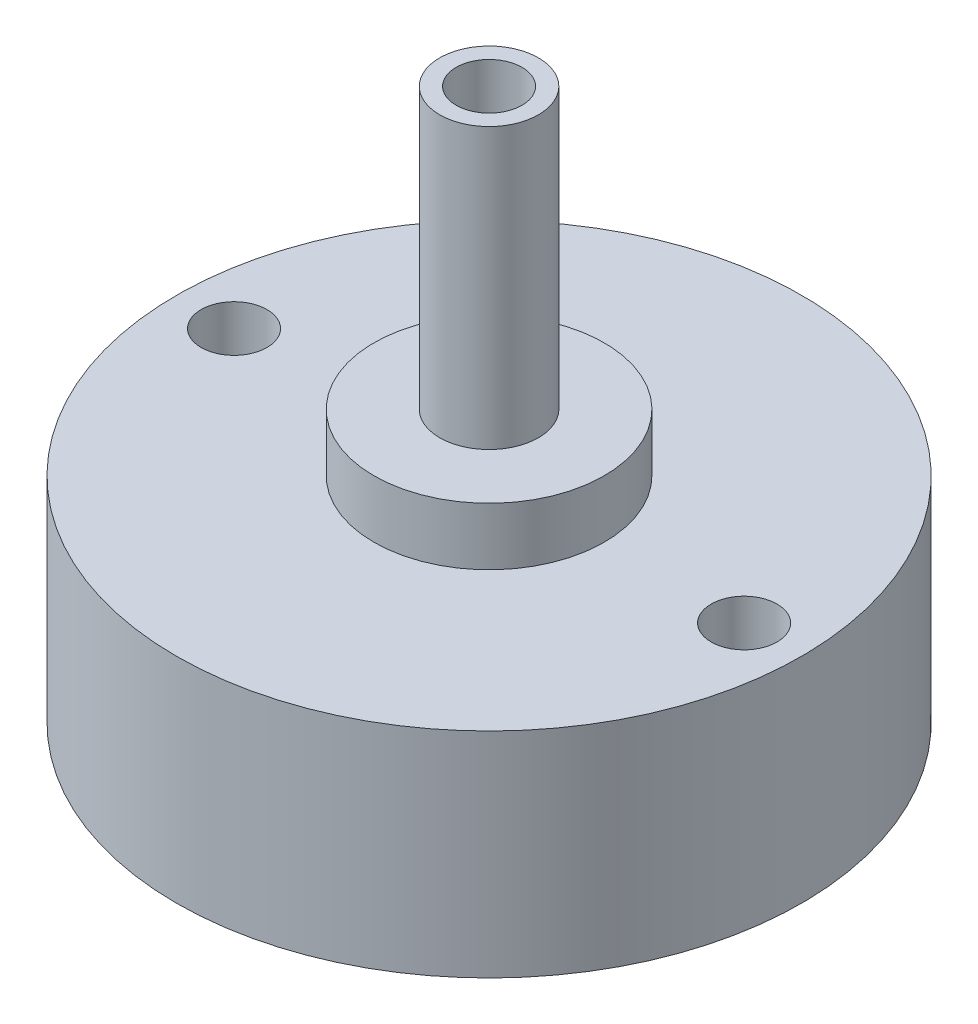
ISO-10303-21;
HEADER;
FILE_DESCRIPTION(('STEP AP214'),'2;1');
FILE_NAME('part.step','',(''),(''),'','','');
FILE_SCHEMA(('AUTOMOTIVE_DESIGN { 1 0 10303 214 1 1 1 1 }'));
ENDSEC;
DATA;
#1=APPLICATION_CONTEXT('core data for automotive mechanical design processes');
#2=APPLICATION_PROTOCOL_DEFINITION('international standard','automotive_design',2000,#1);
#3=PRODUCT_CONTEXT('',#1,'mechanical');
#4=PRODUCT('Part','Part','',(#3));
#5=PRODUCT_RELATED_PRODUCT_CATEGORY('part','',(#4));
#6=PRODUCT_DEFINITION_FORMATION('','',#4);
#7=PRODUCT_DEFINITION_CONTEXT('part definition',#1,'design');
#8=PRODUCT_DEFINITION('design','',#6,#7);
#9=PRODUCT_DEFINITION_SHAPE('','',#8);
#10=(LENGTH_UNIT() NAMED_UNIT(*) SI_UNIT(.MILLI.,.METRE.));
#11=(NAMED_UNIT(*) PLANE_ANGLE_UNIT() SI_UNIT($,.RADIAN.));
#12=(NAMED_UNIT(*) SI_UNIT($,.STERADIAN.) SOLID_ANGLE_UNIT());
#13=UNCERTAINTY_MEASURE_WITH_UNIT(LENGTH_MEASURE(1.E-05),#10,'distance_accuracy_value','');
#14=(GEOMETRIC_REPRESENTATION_CONTEXT(3) GLOBAL_UNCERTAINTY_ASSIGNED_CONTEXT((#13)) GLOBAL_UNIT_ASSIGNED_CONTEXT((#10,
#11,#12)) REPRESENTATION_CONTEXT('',''));
#15=CARTESIAN_POINT('',(0.,0.,0.));
#16=DIRECTION('',(0.,0.,1.));
#17=DIRECTION('',(1.,0.,0.));
#18=AXIS2_PLACEMENT_3D('',#15,#16,#17);
#19=CARTESIAN_POINT('',(0.,3.5,0.));
#20=DIRECTION('',(0.,1.,0.));
#21=DIRECTION('',(0.,0.,1.));
#22=AXIS2_PLACEMENT_3D('',#19,#20,#21);
#23=PLANE('',#22);
#24=CARTESIAN_POINT('',(0.,3.5,0.));
#25=DIRECTION('',(0.,1.,0.));
#26=DIRECTION('',(0.,0.,1.));
#27=AXIS2_PLACEMENT_3D('',#24,#25,#26);
#28=CIRCLE('',#27,7.);
#29=CARTESIAN_POINT('',(0.,3.5,7.));
#30=VERTEX_POINT('',#29);
#31=EDGE_CURVE('E57',#30,#30,#28,.T.);
#32=ORIENTED_EDGE('',*,*,#31,.T.);
#33=EDGE_LOOP('',(#32));
#34=FACE_BOUND('',#33,.T.);
#35=CARTESIAN_POINT('',(0.,3.5,0.));
#36=DIRECTION('',(0.,1.,0.));
#37=DIRECTION('',(0.,0.,1.));
#38=AXIS2_PLACEMENT_3D('',#35,#36,#37);
#39=CIRCLE('',#38,3.);
#40=CARTESIAN_POINT('',(0.,3.5,3.));
#41=VERTEX_POINT('',#40);
#42=EDGE_CURVE('E66',#41,#41,#39,.T.);
#43=ORIENTED_EDGE('',*,*,#42,.F.);
#44=EDGE_LOOP('',(#43));
#45=FACE_BOUND('',#44,.T.);
#46=ADVANCED_FACE('F30',(#34,#45),#23,.T.);
#47=CARTESIAN_POINT('',(0.,0.,0.));
#48=DIRECTION('',(0.,1.,0.));
#49=DIRECTION('',(0.,0.,1.));
#50=AXIS2_PLACEMENT_3D('',#47,#48,#49);
#51=PLANE('',#50);
#52=CARTESIAN_POINT('',(0.,0.,0.));
#53=DIRECTION('',(0.,1.,0.));
#54=DIRECTION('',(0.,0.,1.));
#55=AXIS2_PLACEMENT_3D('',#52,#53,#54);
#56=CIRCLE('',#55,19.);
#57=CARTESIAN_POINT('',(0.,0.,19.));
#58=VERTEX_POINT('',#57);
#59=EDGE_CURVE('E41',#58,#58,#56,.T.);
#60=ORIENTED_EDGE('',*,*,#59,.T.);
#61=EDGE_LOOP('',(#60));
#62=FACE_BOUND('',#61,.T.);
#63=CARTESIAN_POINT('',(-15.5,0.,0.));
#64=DIRECTION('',(0.,1.,0.));
#65=DIRECTION('',(0.,0.,1.));
#66=AXIS2_PLACEMENT_3D('',#63,#64,#65);
#67=CIRCLE('',#66,2.);
#68=CARTESIAN_POINT('',(-15.5,0.,2.));
#69=VERTEX_POINT('',#68);
#70=EDGE_CURVE('E48',#69,#69,#67,.T.);
#71=ORIENTED_EDGE('',*,*,#70,.F.);
#72=EDGE_LOOP('',(#71));
#73=FACE_BOUND('',#72,.T.);
#74=CARTESIAN_POINT('',(15.5,0.,0.));
#75=DIRECTION('',(0.,1.,0.));
#76=DIRECTION('',(0.,0.,1.));
#77=AXIS2_PLACEMENT_3D('',#74,#75,#76);
#78=CIRCLE('',#77,2.);
#79=CARTESIAN_POINT('',(15.5,0.,2.));
#80=VERTEX_POINT('',#79);
#81=EDGE_CURVE('E54',#80,#80,#78,.T.);
#82=ORIENTED_EDGE('',*,*,#81,.F.);
#83=EDGE_LOOP('',(#82));
#84=FACE_BOUND('',#83,.T.);
#85=CARTESIAN_POINT('',(0.,0.,0.));
#86=DIRECTION('',(0.,1.,0.));
#87=DIRECTION('',(0.,0.,1.));
#88=AXIS2_PLACEMENT_3D('',#85,#86,#87);
#89=CIRCLE('',#88,7.);
#90=CARTESIAN_POINT('',(0.,0.,7.));
#91=VERTEX_POINT('',#90);
#92=EDGE_CURVE('E60',#91,#91,#89,.T.);
#93=ORIENTED_EDGE('',*,*,#92,.F.);
#94=EDGE_LOOP('',(#93));
#95=FACE_BOUND('',#94,.T.);
#96=ADVANCED_FACE('F94',(#62,#73,#84,#95),#51,.T.);
#97=CARTESIAN_POINT('',(0.,-13.,0.));
#98=DIRECTION('',(0.,1.,0.));
#99=DIRECTION('',(0.,0.,1.));
#100=AXIS2_PLACEMENT_3D('',#97,#98,#99);
#101=CYLINDRICAL_SURFACE('',#100,19.);
#102=CARTESIAN_POINT('',(0.,-13.,0.));
#103=DIRECTION('',(0.,1.,0.));
#104=DIRECTION('',(0.,0.,1.));
#105=AXIS2_PLACEMENT_3D('',#102,#103,#104);
#106=CIRCLE('',#105,19.);
#107=CARTESIAN_POINT('',(0.,-13.,19.));
#108=VERTEX_POINT('',#107);
#109=EDGE_CURVE('E37',#108,#108,#106,.T.);
#110=ORIENTED_EDGE('',*,*,#109,.T.);
#111=EDGE_LOOP('',(#110));
#112=FACE_BOUND('',#111,.T.);
#113=ORIENTED_EDGE('',*,*,#59,.F.);
#114=EDGE_LOOP('',(#113));
#115=FACE_BOUND('',#114,.T.);
#116=ADVANCED_FACE('F32',(#112,#115),#101,.T.);
#117=CARTESIAN_POINT('',(0.,-13.,0.));
#118=DIRECTION('',(0.,1.,0.));
#119=DIRECTION('',(0.,0.,1.));
#120=AXIS2_PLACEMENT_3D('',#117,#118,#119);
#121=PLANE('',#120);
#122=ORIENTED_EDGE('',*,*,#109,.F.);
#123=EDGE_LOOP('',(#122));
#124=FACE_BOUND('',#123,.T.);
#125=ADVANCED_FACE('F175',(#124),#121,.F.);
#126=CARTESIAN_POINT('',(-15.5,-10.,0.));
#127=DIRECTION('',(0.,1.,0.));
#128=DIRECTION('',(0.,0.,1.));
#129=AXIS2_PLACEMENT_3D('',#126,#127,#128);
#130=CYLINDRICAL_SURFACE('',#129,2.);
#131=CARTESIAN_POINT('',(-15.5,-10.,0.));
#132=DIRECTION('',(0.,1.,0.));
#133=DIRECTION('',(0.,0.,1.));
#134=AXIS2_PLACEMENT_3D('',#131,#132,#133);
#135=CIRCLE('',#134,2.);
#136=CARTESIAN_POINT('',(-15.5,-10.,2.));
#137=VERTEX_POINT('',#136);
#138=EDGE_CURVE('E46',#137,#137,#135,.T.);
#139=ORIENTED_EDGE('',*,*,#138,.F.);
#140=EDGE_LOOP('',(#139));
#141=FACE_BOUND('',#140,.T.);
#142=ORIENTED_EDGE('',*,*,#70,.T.);
#143=EDGE_LOOP('',(#142));
#144=FACE_BOUND('',#143,.T.);
#145=ADVANCED_FACE('F165',(#141,#144),#130,.F.);
#146=CARTESIAN_POINT('',(-15.5,-10.,0.));
#147=DIRECTION('',(0.,1.,0.));
#148=DIRECTION('',(0.,0.,1.));
#149=AXIS2_PLACEMENT_3D('',#146,#147,#148);
#150=PLANE('',#149);
#151=ORIENTED_EDGE('',*,*,#138,.T.);
#152=EDGE_LOOP('',(#151));
#153=FACE_BOUND('',#152,.T.);
#154=ADVANCED_FACE('F155',(#153),#150,.T.);
#155=CARTESIAN_POINT('',(15.5,-10.,0.));
#156=DIRECTION('',(0.,1.,0.));
#157=DIRECTION('',(0.,0.,1.));
#158=AXIS2_PLACEMENT_3D('',#155,#156,#157);
#159=CYLINDRICAL_SURFACE('',#158,2.);
#160=CARTESIAN_POINT('',(15.5,-10.,0.));
#161=DIRECTION('',(0.,1.,0.));
#162=DIRECTION('',(0.,0.,1.));
#163=AXIS2_PLACEMENT_3D('',#160,#161,#162);
#164=CIRCLE('',#163,2.);
#165=CARTESIAN_POINT('',(15.5,-10.,2.));
#166=VERTEX_POINT('',#165);
#167=EDGE_CURVE('E51',#166,#166,#164,.T.);
#168=ORIENTED_EDGE('',*,*,#167,.F.);
#169=EDGE_LOOP('',(#168));
#170=FACE_BOUND('',#169,.T.);
#171=ORIENTED_EDGE('',*,*,#81,.T.);
#172=EDGE_LOOP('',(#171));
#173=FACE_BOUND('',#172,.T.);
#174=ADVANCED_FACE('F145',(#170,#173),#159,.F.);
#175=CARTESIAN_POINT('',(15.5,-10.,0.));
#176=DIRECTION('',(0.,1.,0.));
#177=DIRECTION('',(0.,0.,1.));
#178=AXIS2_PLACEMENT_3D('',#175,#176,#177);
#179=PLANE('',#178);
#180=ORIENTED_EDGE('',*,*,#167,.T.);
#181=EDGE_LOOP('',(#180));
#182=FACE_BOUND('',#181,.T.);
#183=ADVANCED_FACE('F89',(#182),#179,.T.);
#184=CARTESIAN_POINT('',(0.,3.5,0.));
#185=DIRECTION('',(0.,-1.,0.));
#186=DIRECTION('',(0.,0.,-1.));
#187=AXIS2_PLACEMENT_3D('',#184,#185,#186);
#188=CYLINDRICAL_SURFACE('',#187,7.);
#189=ORIENTED_EDGE('',*,*,#31,.F.);
#190=EDGE_LOOP('',(#189));
#191=FACE_BOUND('',#190,.T.);
#192=ORIENTED_EDGE('',*,*,#92,.T.);
#193=EDGE_LOOP('',(#192));
#194=FACE_BOUND('',#193,.T.);
#195=ADVANCED_FACE('F80',(#191,#194),#188,.T.);
#196=CARTESIAN_POINT('',(0.,20.5,0.));
#197=DIRECTION('',(0.,1.,0.));
#198=DIRECTION('',(0.,0.,1.));
#199=AXIS2_PLACEMENT_3D('',#196,#197,#198);
#200=PLANE('',#199);
#201=CARTESIAN_POINT('',(0.,20.5,0.));
#202=DIRECTION('',(0.,1.,0.));
#203=DIRECTION('',(0.,0.,1.));
#204=AXIS2_PLACEMENT_3D('',#201,#202,#203);
#205=CIRCLE('',#204,3.);
#206=CARTESIAN_POINT('',(0.,20.5,3.));
#207=VERTEX_POINT('',#206);
#208=EDGE_CURVE('E63',#207,#207,#205,.T.);
#209=ORIENTED_EDGE('',*,*,#208,.T.);
#210=EDGE_LOOP('',(#209));
#211=FACE_BOUND('',#210,.T.);
#212=CARTESIAN_POINT('',(0.,20.5,0.));
#213=DIRECTION('',(0.,1.,0.));
#214=DIRECTION('',(0.,0.,1.));
#215=AXIS2_PLACEMENT_3D('',#212,#213,#214);
#216=CIRCLE('',#215,2.);
#217=CARTESIAN_POINT('',(0.,20.5,2.));
#218=VERTEX_POINT('',#217);
#219=EDGE_CURVE('E69',#218,#218,#216,.T.);
#220=ORIENTED_EDGE('',*,*,#219,.F.);
#221=EDGE_LOOP('',(#220));
#222=FACE_BOUND('',#221,.T.);
#223=ADVANCED_FACE('F77',(#211,#222),#200,.T.);
#224=CARTESIAN_POINT('',(0.,20.5,0.));
#225=DIRECTION('',(0.,-1.,0.));
#226=DIRECTION('',(0.,0.,-1.));
#227=AXIS2_PLACEMENT_3D('',#224,#225,#226);
#228=CYLINDRICAL_SURFACE('',#227,3.);
#229=ORIENTED_EDGE('',*,*,#208,.F.);
#230=EDGE_LOOP('',(#229));
#231=FACE_BOUND('',#230,.T.);
#232=ORIENTED_EDGE('',*,*,#42,.T.);
#233=EDGE_LOOP('',(#232));
#234=FACE_BOUND('',#233,.T.);
#235=ADVANCED_FACE('F79',(#231,#234),#228,.T.);
#236=CARTESIAN_POINT('',(0.,20.5,0.));
#237=DIRECTION('',(0.,-1.,0.));
#238=DIRECTION('',(0.,0.,-1.));
#239=AXIS2_PLACEMENT_3D('',#236,#237,#238);
#240=CYLINDRICAL_SURFACE('',#239,2.);
#241=ORIENTED_EDGE('',*,*,#219,.T.);
#242=EDGE_LOOP('',(#241));
#243=FACE_BOUND('',#242,.T.);
#244=CARTESIAN_POINT('',(0.,3.5,0.));
#245=DIRECTION('',(0.,1.,0.));
#246=DIRECTION('',(0.,0.,1.));
#247=AXIS2_PLACEMENT_3D('',#244,#245,#246);
#248=CIRCLE('',#247,2.);
#249=CARTESIAN_POINT('',(0.,3.5,2.));
#250=VERTEX_POINT('',#249);
#251=EDGE_CURVE('E10',#250,#250,#248,.F.);
#252=ORIENTED_EDGE('',*,*,#251,.T.);
#253=EDGE_LOOP('',(#252));
#254=FACE_BOUND('',#253,.T.);
#255=ADVANCED_FACE('F75',(#243,#254),#240,.F.);
#256=ORIENTED_EDGE('',*,*,#251,.F.);
#257=EDGE_LOOP('',(#256));
#258=FACE_BOUND('',#257,.T.);
#259=ADVANCED_FACE('F97',(#258),#23,.T.);
#260=CLOSED_SHELL('',(#46,#96,#116,#125,#145,#154,#174,#183,#195,#223,#235,#255,#259));
#261=MANIFOLD_SOLID_BREP('B2',#260);
#262=ADVANCED_BREP_SHAPE_REPRESENTATION('',(#18,#261),#14);
#263=SHAPE_DEFINITION_REPRESENTATION(#9,#262);
ENDSEC;
END-ISO-10303-21;
